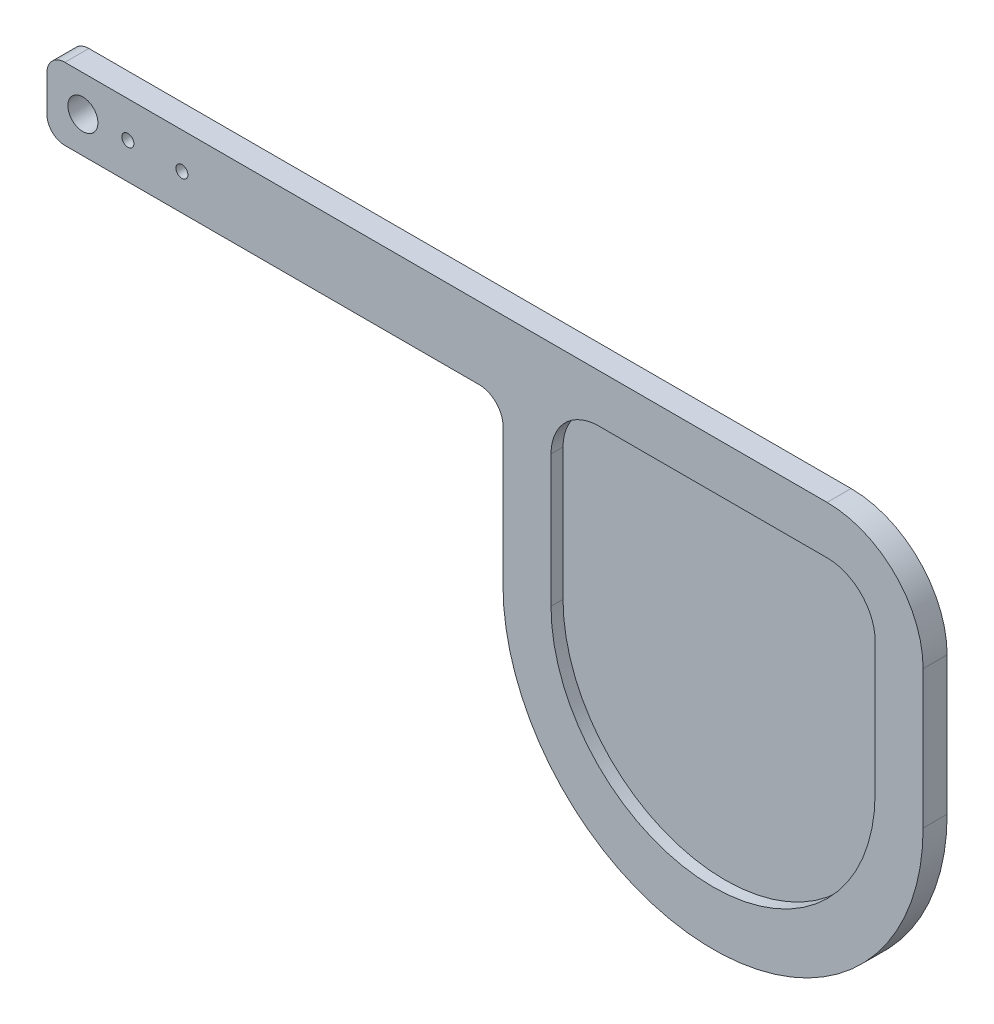
ISO-10303-21;
HEADER;
FILE_DESCRIPTION(('STEP AP214'),'2;1');
FILE_NAME('part.step','',(''),(''),'','','');
FILE_SCHEMA(('AUTOMOTIVE_DESIGN { 1 0 10303 214 1 1 1 1 }'));
ENDSEC;
DATA;
#1=APPLICATION_CONTEXT('core data for automotive mechanical design processes');
#2=APPLICATION_PROTOCOL_DEFINITION('international standard','automotive_design',2000,#1);
#3=PRODUCT_CONTEXT('',#1,'mechanical');
#4=PRODUCT('Part','Part','',(#3));
#5=PRODUCT_RELATED_PRODUCT_CATEGORY('part','',(#4));
#6=PRODUCT_DEFINITION_FORMATION('','',#4);
#7=PRODUCT_DEFINITION_CONTEXT('part definition',#1,'design');
#8=PRODUCT_DEFINITION('design','',#6,#7);
#9=PRODUCT_DEFINITION_SHAPE('','',#8);
#10=(LENGTH_UNIT() NAMED_UNIT(*) SI_UNIT(.MILLI.,.METRE.));
#11=(NAMED_UNIT(*) PLANE_ANGLE_UNIT() SI_UNIT($,.RADIAN.));
#12=(NAMED_UNIT(*) SI_UNIT($,.STERADIAN.) SOLID_ANGLE_UNIT());
#13=UNCERTAINTY_MEASURE_WITH_UNIT(LENGTH_MEASURE(1.E-05),#10,'distance_accuracy_value','');
#14=(GEOMETRIC_REPRESENTATION_CONTEXT(3) GLOBAL_UNCERTAINTY_ASSIGNED_CONTEXT((#13)) GLOBAL_UNIT_ASSIGNED_CONTEXT((#10,
#11,#12)) REPRESENTATION_CONTEXT('',''));
#15=CARTESIAN_POINT('',(0.,0.,0.));
#16=DIRECTION('',(0.,0.,1.));
#17=DIRECTION('',(1.,0.,0.));
#18=AXIS2_PLACEMENT_3D('',#15,#16,#17);
#19=CARTESIAN_POINT('',(72.,-4.,4.));
#20=DIRECTION('',(0.,0.,-1.));
#21=DIRECTION('',(-1.,0.,0.));
#22=AXIS2_PLACEMENT_3D('',#19,#20,#21);
#23=PLANE('',#22);
#24=DIRECTION('',(-1.,0.,0.));
#25=VECTOR('',#24,1.);
#26=CARTESIAN_POINT('',(92.0000000000001,4.,4.));
#27=LINE('',#26,#25);
#28=CARTESIAN_POINT('',(130.,4.,4.));
#29=VERTEX_POINT('',#28);
#30=CARTESIAN_POINT('',(92.0000000000001,4.,4.));
#31=VERTEX_POINT('',#30);
#32=EDGE_CURVE('E273',#29,#31,#27,.T.);
#33=ORIENTED_EDGE('',*,*,#32,.F.);
#34=CARTESIAN_POINT('',(130.,-4.,4.));
#35=DIRECTION('',(0.,0.,1.));
#36=DIRECTION('',(-1.,0.,0.));
#37=AXIS2_PLACEMENT_3D('',#34,#35,#36);
#38=CIRCLE('',#37,8.00000000000002);
#39=CARTESIAN_POINT('',(138.,-4.,4.));
#40=VERTEX_POINT('',#39);
#41=EDGE_CURVE('E52',#40,#29,#38,.T.);
#42=ORIENTED_EDGE('',*,*,#41,.F.);
#43=DIRECTION('',(0.,1.,0.));
#44=VECTOR('',#43,1.);
#45=CARTESIAN_POINT('',(138.,-4.,4.));
#46=LINE('',#45,#44);
#47=CARTESIAN_POINT('',(138.,-26.,4.));
#48=VERTEX_POINT('',#47);
#49=EDGE_CURVE('E260',#48,#40,#46,.T.);
#50=ORIENTED_EDGE('',*,*,#49,.F.);
#51=CARTESIAN_POINT('',(111.,-26.,4.));
#52=DIRECTION('',(0.,0.,1.));
#53=DIRECTION('',(-1.,0.,0.));
#54=AXIS2_PLACEMENT_3D('',#51,#52,#53);
#55=CIRCLE('',#54,27.);
#56=CARTESIAN_POINT('',(84.,-26.,4.));
#57=VERTEX_POINT('',#56);
#58=EDGE_CURVE('E264',#57,#48,#55,.T.);
#59=ORIENTED_EDGE('',*,*,#58,.F.);
#60=DIRECTION('',(0.,-1.,0.));
#61=VECTOR('',#60,1.);
#62=CARTESIAN_POINT('',(84.,-26.,4.));
#63=LINE('',#62,#61);
#64=CARTESIAN_POINT('',(84.,-4.00000000000006,4.));
#65=VERTEX_POINT('',#64);
#66=EDGE_CURVE('E267',#65,#57,#63,.T.);
#67=ORIENTED_EDGE('',*,*,#66,.F.);
#68=CARTESIAN_POINT('',(92.,-4.,4.));
#69=DIRECTION('',(0.,0.,1.));
#70=DIRECTION('',(1.,0.,0.));
#71=AXIS2_PLACEMENT_3D('',#68,#69,#70);
#72=CIRCLE('',#71,8.);
#73=EDGE_CURVE('E270',#31,#65,#72,.T.);
#74=ORIENTED_EDGE('',*,*,#73,.F.);
#75=EDGE_LOOP('',(#33,#42,#50,#59,#67,#74));
#76=FACE_BOUND('',#75,.T.);
#77=CARTESIAN_POINT('',(72.,-4.,4.));
#78=DIRECTION('',(0.,0.,-1.));
#79=DIRECTION('',(-1.,0.,0.));
#80=AXIS2_PLACEMENT_3D('',#77,#78,#79);
#81=CIRCLE('',#80,3.99999999999999);
#82=CARTESIAN_POINT('',(72.,0.,4.));
#83=VERTEX_POINT('',#82);
#84=CARTESIAN_POINT('',(76.,-4.,4.));
#85=VERTEX_POINT('',#84);
#86=EDGE_CURVE('E178',#83,#85,#81,.T.);
#87=ORIENTED_EDGE('',*,*,#86,.T.);
#88=DIRECTION('',(0.,-1.,0.));
#89=VECTOR('',#88,1.);
#90=CARTESIAN_POINT('',(76.,-4.,4.));
#91=LINE('',#90,#89);
#92=CARTESIAN_POINT('',(76.,-27.,4.));
#93=VERTEX_POINT('',#92);
#94=EDGE_CURVE('E108',#85,#93,#91,.T.);
#95=ORIENTED_EDGE('',*,*,#94,.T.);
#96=CARTESIAN_POINT('',(111.,-27.,4.));
#97=DIRECTION('',(0.,0.,1.));
#98=DIRECTION('',(1.,0.,0.));
#99=AXIS2_PLACEMENT_3D('',#96,#97,#98);
#100=CIRCLE('',#99,35.);
#101=CARTESIAN_POINT('',(146.,-27.,4.));
#102=VERTEX_POINT('',#101);
#103=EDGE_CURVE('E199',#93,#102,#100,.T.);
#104=ORIENTED_EDGE('',*,*,#103,.T.);
#105=DIRECTION('',(0.,1.,0.));
#106=VECTOR('',#105,1.);
#107=CARTESIAN_POINT('',(146.,-27.,4.));
#108=LINE('',#107,#106);
#109=CARTESIAN_POINT('',(146.,-3.99999999999998,4.));
#110=VERTEX_POINT('',#109);
#111=EDGE_CURVE('E218',#102,#110,#108,.T.);
#112=ORIENTED_EDGE('',*,*,#111,.T.);
#113=CARTESIAN_POINT('',(130.,-3.99999999999998,4.));
#114=DIRECTION('',(0.,0.,1.));
#115=DIRECTION('',(1.,0.,0.));
#116=AXIS2_PLACEMENT_3D('',#113,#114,#115);
#117=CIRCLE('',#116,16.);
#118=CARTESIAN_POINT('',(130.,12.,4.));
#119=VERTEX_POINT('',#118);
#120=EDGE_CURVE('E215',#110,#119,#117,.T.);
#121=ORIENTED_EDGE('',*,*,#120,.T.);
#122=DIRECTION('',(-1.,0.,0.));
#123=VECTOR('',#122,1.);
#124=CARTESIAN_POINT('',(130.,12.,4.));
#125=LINE('',#124,#123);
#126=CARTESIAN_POINT('',(3.00000000000002,12.,4.));
#127=VERTEX_POINT('',#126);
#128=EDGE_CURVE('E217',#119,#127,#125,.T.);
#129=ORIENTED_EDGE('',*,*,#128,.T.);
#130=CARTESIAN_POINT('',(3.,9.,4.));
#131=DIRECTION('',(0.,0.,1.));
#132=DIRECTION('',(1.,0.,0.));
#133=AXIS2_PLACEMENT_3D('',#130,#131,#132);
#134=CIRCLE('',#133,3.);
#135=CARTESIAN_POINT('',(0.,8.99999999999998,4.));
#136=VERTEX_POINT('',#135);
#137=EDGE_CURVE('E137',#127,#136,#134,.T.);
#138=ORIENTED_EDGE('',*,*,#137,.T.);
#139=DIRECTION('',(0.,-1.,0.));
#140=VECTOR('',#139,1.);
#141=CARTESIAN_POINT('',(0.,8.99999999999998,4.));
#142=LINE('',#141,#140);
#143=CARTESIAN_POINT('',(0.,3.,4.));
#144=VERTEX_POINT('',#143);
#145=EDGE_CURVE('E130',#136,#144,#142,.T.);
#146=ORIENTED_EDGE('',*,*,#145,.T.);
#147=CARTESIAN_POINT('',(3.,3.,4.));
#148=DIRECTION('',(0.,0.,1.));
#149=DIRECTION('',(-1.,0.,0.));
#150=AXIS2_PLACEMENT_3D('',#147,#148,#149);
#151=CIRCLE('',#150,3.);
#152=CARTESIAN_POINT('',(3.00000000000002,0.,4.));
#153=VERTEX_POINT('',#152);
#154=EDGE_CURVE('E134',#144,#153,#151,.T.);
#155=ORIENTED_EDGE('',*,*,#154,.T.);
#156=DIRECTION('',(1.,0.,0.));
#157=VECTOR('',#156,1.);
#158=CARTESIAN_POINT('',(3.00000000000002,0.,4.));
#159=LINE('',#158,#157);
#160=EDGE_CURVE('E61',#153,#83,#159,.T.);
#161=ORIENTED_EDGE('',*,*,#160,.T.);
#162=EDGE_LOOP('',(#87,#95,#104,#112,#121,#129,#138,#146,#155,#161));
#163=FACE_BOUND('',#162,.T.);
#164=CARTESIAN_POINT('',(6.,6.,4.));
#165=DIRECTION('',(0.,0.,1.));
#166=DIRECTION('',(1.,0.,0.));
#167=AXIS2_PLACEMENT_3D('',#164,#165,#166);
#168=CIRCLE('',#167,2.5);
#169=CARTESIAN_POINT('',(8.5,6.,4.));
#170=VERTEX_POINT('',#169);
#171=EDGE_CURVE('E162',#170,#170,#168,.T.);
#172=ORIENTED_EDGE('',*,*,#171,.F.);
#173=EDGE_LOOP('',(#172));
#174=FACE_BOUND('',#173,.T.);
#175=CARTESIAN_POINT('',(13.5,6.,4.));
#176=DIRECTION('',(0.,0.,1.));
#177=DIRECTION('',(1.,0.,0.));
#178=AXIS2_PLACEMENT_3D('',#175,#176,#177);
#179=CIRCLE('',#178,1.);
#180=CARTESIAN_POINT('',(14.5,6.,4.));
#181=VERTEX_POINT('',#180);
#182=EDGE_CURVE('E229',#181,#181,#179,.T.);
#183=ORIENTED_EDGE('',*,*,#182,.F.);
#184=EDGE_LOOP('',(#183));
#185=FACE_BOUND('',#184,.T.);
#186=CARTESIAN_POINT('',(22.5,6.,4.));
#187=DIRECTION('',(0.,0.,1.));
#188=DIRECTION('',(1.,0.,0.));
#189=AXIS2_PLACEMENT_3D('',#186,#187,#188);
#190=CIRCLE('',#189,1.);
#191=CARTESIAN_POINT('',(23.5,6.,4.));
#192=VERTEX_POINT('',#191);
#193=EDGE_CURVE('E235',#192,#192,#190,.T.);
#194=ORIENTED_EDGE('',*,*,#193,.F.);
#195=EDGE_LOOP('',(#194));
#196=FACE_BOUND('',#195,.T.);
#197=ADVANCED_FACE('F37',(#76,#163,#174,#185,#196),#23,.F.);
#198=CARTESIAN_POINT('',(72.,-4.,0.));
#199=DIRECTION('',(0.,0.,-1.));
#200=DIRECTION('',(-1.,0.,0.));
#201=AXIS2_PLACEMENT_3D('',#198,#199,#200);
#202=PLANE('',#201);
#203=CARTESIAN_POINT('',(13.5,6.,0.));
#204=DIRECTION('',(0.,0.,1.));
#205=DIRECTION('',(1.,0.,0.));
#206=AXIS2_PLACEMENT_3D('',#203,#204,#205);
#207=CIRCLE('',#206,1.);
#208=CARTESIAN_POINT('',(14.5,6.,0.));
#209=VERTEX_POINT('',#208);
#210=EDGE_CURVE('E232',#209,#209,#207,.T.);
#211=ORIENTED_EDGE('',*,*,#210,.T.);
#212=EDGE_LOOP('',(#211));
#213=FACE_BOUND('',#212,.T.);
#214=CARTESIAN_POINT('',(72.,-4.,0.));
#215=DIRECTION('',(0.,0.,-1.));
#216=DIRECTION('',(-1.,0.,0.));
#217=AXIS2_PLACEMENT_3D('',#214,#215,#216);
#218=CIRCLE('',#217,3.99999999999999);
#219=CARTESIAN_POINT('',(72.,0.,0.));
#220=VERTEX_POINT('',#219);
#221=CARTESIAN_POINT('',(76.,-4.,0.));
#222=VERTEX_POINT('',#221);
#223=EDGE_CURVE('E158',#220,#222,#218,.T.);
#224=ORIENTED_EDGE('',*,*,#223,.F.);
#225=DIRECTION('',(1.,0.,0.));
#226=VECTOR('',#225,1.);
#227=CARTESIAN_POINT('',(3.00000000000002,0.,0.));
#228=LINE('',#227,#226);
#229=CARTESIAN_POINT('',(3.00000000000002,0.,0.));
#230=VERTEX_POINT('',#229);
#231=EDGE_CURVE('E100',#230,#220,#228,.T.);
#232=ORIENTED_EDGE('',*,*,#231,.F.);
#233=CARTESIAN_POINT('',(3.,3.,0.));
#234=DIRECTION('',(0.,0.,1.));
#235=DIRECTION('',(-1.,0.,0.));
#236=AXIS2_PLACEMENT_3D('',#233,#234,#235);
#237=CIRCLE('',#236,3.);
#238=CARTESIAN_POINT('',(0.,3.,0.));
#239=VERTEX_POINT('',#238);
#240=EDGE_CURVE('E175',#239,#230,#237,.T.);
#241=ORIENTED_EDGE('',*,*,#240,.F.);
#242=DIRECTION('',(0.,-1.,0.));
#243=VECTOR('',#242,1.);
#244=CARTESIAN_POINT('',(0.,8.99999999999998,0.));
#245=LINE('',#244,#243);
#246=CARTESIAN_POINT('',(0.,8.99999999999998,0.));
#247=VERTEX_POINT('',#246);
#248=EDGE_CURVE('E146',#247,#239,#245,.T.);
#249=ORIENTED_EDGE('',*,*,#248,.F.);
#250=CARTESIAN_POINT('',(3.,9.,0.));
#251=DIRECTION('',(0.,0.,1.));
#252=DIRECTION('',(1.,0.,0.));
#253=AXIS2_PLACEMENT_3D('',#250,#251,#252);
#254=CIRCLE('',#253,3.);
#255=CARTESIAN_POINT('',(3.00000000000002,12.,0.));
#256=VERTEX_POINT('',#255);
#257=EDGE_CURVE('E172',#256,#247,#254,.T.);
#258=ORIENTED_EDGE('',*,*,#257,.F.);
#259=DIRECTION('',(-1.,0.,0.));
#260=VECTOR('',#259,1.);
#261=CARTESIAN_POINT('',(130.,12.,0.));
#262=LINE('',#261,#260);
#263=CARTESIAN_POINT('',(130.,12.,0.));
#264=VERTEX_POINT('',#263);
#265=EDGE_CURVE('E170',#264,#256,#262,.T.);
#266=ORIENTED_EDGE('',*,*,#265,.F.);
#267=CARTESIAN_POINT('',(130.,-3.99999999999998,0.));
#268=DIRECTION('',(0.,0.,1.));
#269=DIRECTION('',(1.,0.,0.));
#270=AXIS2_PLACEMENT_3D('',#267,#268,#269);
#271=CIRCLE('',#270,16.);
#272=CARTESIAN_POINT('',(146.,-3.99999999999998,0.));
#273=VERTEX_POINT('',#272);
#274=EDGE_CURVE('E168',#273,#264,#271,.T.);
#275=ORIENTED_EDGE('',*,*,#274,.F.);
#276=DIRECTION('',(0.,1.,0.));
#277=VECTOR('',#276,1.);
#278=CARTESIAN_POINT('',(146.,-27.,0.));
#279=LINE('',#278,#277);
#280=CARTESIAN_POINT('',(146.,-27.,0.));
#281=VERTEX_POINT('',#280);
#282=EDGE_CURVE('E166',#281,#273,#279,.T.);
#283=ORIENTED_EDGE('',*,*,#282,.F.);
#284=CARTESIAN_POINT('',(111.,-27.,0.));
#285=DIRECTION('',(0.,0.,1.));
#286=DIRECTION('',(1.,0.,0.));
#287=AXIS2_PLACEMENT_3D('',#284,#285,#286);
#288=CIRCLE('',#287,35.);
#289=CARTESIAN_POINT('',(76.,-27.,0.));
#290=VERTEX_POINT('',#289);
#291=EDGE_CURVE('E164',#290,#281,#288,.T.);
#292=ORIENTED_EDGE('',*,*,#291,.F.);
#293=DIRECTION('',(0.,-1.,0.));
#294=VECTOR('',#293,1.);
#295=CARTESIAN_POINT('',(76.,-4.,0.));
#296=LINE('',#295,#294);
#297=EDGE_CURVE('E161',#222,#290,#296,.T.);
#298=ORIENTED_EDGE('',*,*,#297,.F.);
#299=EDGE_LOOP('',(#224,#232,#241,#249,#258,#266,#275,#283,#292,#298));
#300=FACE_BOUND('',#299,.T.);
#301=CARTESIAN_POINT('',(6.,6.,0.));
#302=DIRECTION('',(0.,0.,1.));
#303=DIRECTION('',(1.,0.,0.));
#304=AXIS2_PLACEMENT_3D('',#301,#302,#303);
#305=CIRCLE('',#304,2.5);
#306=CARTESIAN_POINT('',(8.5,6.,0.));
#307=VERTEX_POINT('',#306);
#308=EDGE_CURVE('E226',#307,#307,#305,.T.);
#309=ORIENTED_EDGE('',*,*,#308,.T.);
#310=EDGE_LOOP('',(#309));
#311=FACE_BOUND('',#310,.T.);
#312=CARTESIAN_POINT('',(22.5,6.,0.));
#313=DIRECTION('',(0.,0.,1.));
#314=DIRECTION('',(1.,0.,0.));
#315=AXIS2_PLACEMENT_3D('',#312,#313,#314);
#316=CIRCLE('',#315,1.);
#317=CARTESIAN_POINT('',(23.5,6.,0.));
#318=VERTEX_POINT('',#317);
#319=EDGE_CURVE('E238',#318,#318,#316,.T.);
#320=ORIENTED_EDGE('',*,*,#319,.T.);
#321=EDGE_LOOP('',(#320));
#322=FACE_BOUND('',#321,.T.);
#323=ADVANCED_FACE('F203',(#213,#300,#311,#322),#202,.T.);
#324=CARTESIAN_POINT('',(72.,-4.,4.));
#325=DIRECTION('',(0.,0.,-1.));
#326=DIRECTION('',(-1.,0.,0.));
#327=AXIS2_PLACEMENT_3D('',#324,#325,#326);
#328=CYLINDRICAL_SURFACE('',#327,3.99999999999999);
#329=ORIENTED_EDGE('',*,*,#223,.T.);
#330=DIRECTION('',(0.,0.,-1.));
#331=VECTOR('',#330,1.);
#332=CARTESIAN_POINT('',(76.,-4.,4.));
#333=LINE('',#332,#331);
#334=EDGE_CURVE('E11',#85,#222,#333,.T.);
#335=ORIENTED_EDGE('',*,*,#334,.F.);
#336=ORIENTED_EDGE('',*,*,#86,.F.);
#337=DIRECTION('',(0.,0.,-1.));
#338=VECTOR('',#337,1.);
#339=CARTESIAN_POINT('',(72.,0.,4.));
#340=LINE('',#339,#338);
#341=EDGE_CURVE('E154',#83,#220,#340,.T.);
#342=ORIENTED_EDGE('',*,*,#341,.T.);
#343=EDGE_LOOP('',(#329,#335,#336,#342));
#344=FACE_BOUND('',#343,.T.);
#345=ADVANCED_FACE('F39',(#344),#328,.F.);
#346=CARTESIAN_POINT('',(76.,-4.,4.));
#347=DIRECTION('',(1.,0.,0.));
#348=DIRECTION('',(0.,1.,0.));
#349=AXIS2_PLACEMENT_3D('',#346,#347,#348);
#350=PLANE('',#349);
#351=ORIENTED_EDGE('',*,*,#297,.T.);
#352=DIRECTION('',(0.,0.,-1.));
#353=VECTOR('',#352,1.);
#354=CARTESIAN_POINT('',(76.,-27.,4.));
#355=LINE('',#354,#353);
#356=EDGE_CURVE('E45',#93,#290,#355,.T.);
#357=ORIENTED_EDGE('',*,*,#356,.F.);
#358=ORIENTED_EDGE('',*,*,#94,.F.);
#359=ORIENTED_EDGE('',*,*,#334,.T.);
#360=EDGE_LOOP('',(#351,#357,#358,#359));
#361=FACE_BOUND('',#360,.T.);
#362=ADVANCED_FACE('F379',(#361),#350,.F.);
#363=CARTESIAN_POINT('',(111.,-27.,4.));
#364=DIRECTION('',(0.,0.,-1.));
#365=DIRECTION('',(-1.,0.,0.));
#366=AXIS2_PLACEMENT_3D('',#363,#364,#365);
#367=CYLINDRICAL_SURFACE('',#366,35.);
#368=ORIENTED_EDGE('',*,*,#291,.T.);
#369=DIRECTION('',(0.,0.,-1.));
#370=VECTOR('',#369,1.);
#371=CARTESIAN_POINT('',(146.,-27.,4.));
#372=LINE('',#371,#370);
#373=EDGE_CURVE('E191',#102,#281,#372,.T.);
#374=ORIENTED_EDGE('',*,*,#373,.F.);
#375=ORIENTED_EDGE('',*,*,#103,.F.);
#376=ORIENTED_EDGE('',*,*,#356,.T.);
#377=EDGE_LOOP('',(#368,#374,#375,#376));
#378=FACE_BOUND('',#377,.T.);
#379=ADVANCED_FACE('F197',(#378),#367,.T.);
#380=CARTESIAN_POINT('',(146.,-27.,4.));
#381=DIRECTION('',(-1.,0.,0.));
#382=DIRECTION('',(0.,0.,1.));
#383=AXIS2_PLACEMENT_3D('',#380,#381,#382);
#384=PLANE('',#383);
#385=ORIENTED_EDGE('',*,*,#282,.T.);
#386=DIRECTION('',(0.,0.,-1.));
#387=VECTOR('',#386,1.);
#388=CARTESIAN_POINT('',(146.,-3.99999999999998,4.));
#389=LINE('',#388,#387);
#390=EDGE_CURVE('E188',#110,#273,#389,.T.);
#391=ORIENTED_EDGE('',*,*,#390,.F.);
#392=ORIENTED_EDGE('',*,*,#111,.F.);
#393=ORIENTED_EDGE('',*,*,#373,.T.);
#394=EDGE_LOOP('',(#385,#391,#392,#393));
#395=FACE_BOUND('',#394,.T.);
#396=ADVANCED_FACE('F209',(#395),#384,.F.);
#397=CARTESIAN_POINT('',(130.,-3.99999999999998,4.));
#398=DIRECTION('',(0.,0.,-1.));
#399=DIRECTION('',(-1.,0.,0.));
#400=AXIS2_PLACEMENT_3D('',#397,#398,#399);
#401=CYLINDRICAL_SURFACE('',#400,16.);
#402=ORIENTED_EDGE('',*,*,#274,.T.);
#403=DIRECTION('',(0.,0.,-1.));
#404=VECTOR('',#403,1.);
#405=CARTESIAN_POINT('',(130.,12.,4.));
#406=LINE('',#405,#404);
#407=EDGE_CURVE('E185',#119,#264,#406,.T.);
#408=ORIENTED_EDGE('',*,*,#407,.F.);
#409=ORIENTED_EDGE('',*,*,#120,.F.);
#410=ORIENTED_EDGE('',*,*,#390,.T.);
#411=EDGE_LOOP('',(#402,#408,#409,#410));
#412=FACE_BOUND('',#411,.T.);
#413=ADVANCED_FACE('F213',(#412),#401,.T.);
#414=CARTESIAN_POINT('',(130.,12.,4.));
#415=DIRECTION('',(0.,-1.,0.));
#416=DIRECTION('',(1.,0.,0.));
#417=AXIS2_PLACEMENT_3D('',#414,#415,#416);
#418=PLANE('',#417);
#419=ORIENTED_EDGE('',*,*,#265,.T.);
#420=DIRECTION('',(0.,0.,-1.));
#421=VECTOR('',#420,1.);
#422=CARTESIAN_POINT('',(3.00000000000002,12.,4.));
#423=LINE('',#422,#421);
#424=EDGE_CURVE('E182',#127,#256,#423,.T.);
#425=ORIENTED_EDGE('',*,*,#424,.F.);
#426=ORIENTED_EDGE('',*,*,#128,.F.);
#427=ORIENTED_EDGE('',*,*,#407,.T.);
#428=EDGE_LOOP('',(#419,#425,#426,#427));
#429=FACE_BOUND('',#428,.T.);
#430=ADVANCED_FACE('F369',(#429),#418,.F.);
#431=CARTESIAN_POINT('',(3.,9.,4.));
#432=DIRECTION('',(0.,0.,-1.));
#433=DIRECTION('',(-1.,0.,0.));
#434=AXIS2_PLACEMENT_3D('',#431,#432,#433);
#435=CYLINDRICAL_SURFACE('',#434,3.);
#436=ORIENTED_EDGE('',*,*,#257,.T.);
#437=DIRECTION('',(0.,0.,-1.));
#438=VECTOR('',#437,1.);
#439=CARTESIAN_POINT('',(0.,8.99999999999998,4.));
#440=LINE('',#439,#438);
#441=EDGE_CURVE('E149',#136,#247,#440,.T.);
#442=ORIENTED_EDGE('',*,*,#441,.F.);
#443=ORIENTED_EDGE('',*,*,#137,.F.);
#444=ORIENTED_EDGE('',*,*,#424,.T.);
#445=EDGE_LOOP('',(#436,#442,#443,#444));
#446=FACE_BOUND('',#445,.T.);
#447=ADVANCED_FACE('F366',(#446),#435,.T.);
#448=CARTESIAN_POINT('',(0.,8.99999999999998,4.));
#449=DIRECTION('',(1.,0.,0.));
#450=DIRECTION('',(0.,0.,-1.));
#451=AXIS2_PLACEMENT_3D('',#448,#449,#450);
#452=PLANE('',#451);
#453=ORIENTED_EDGE('',*,*,#248,.T.);
#454=DIRECTION('',(0.,0.,-1.));
#455=VECTOR('',#454,1.);
#456=CARTESIAN_POINT('',(0.,3.,4.));
#457=LINE('',#456,#455);
#458=EDGE_CURVE('E143',#144,#239,#457,.T.);
#459=ORIENTED_EDGE('',*,*,#458,.F.);
#460=ORIENTED_EDGE('',*,*,#145,.F.);
#461=ORIENTED_EDGE('',*,*,#441,.T.);
#462=EDGE_LOOP('',(#453,#459,#460,#461));
#463=FACE_BOUND('',#462,.T.);
#464=ADVANCED_FACE('F144',(#463),#452,.F.);
#465=CARTESIAN_POINT('',(3.,3.,4.));
#466=DIRECTION('',(0.,0.,-1.));
#467=DIRECTION('',(-1.,0.,0.));
#468=AXIS2_PLACEMENT_3D('',#465,#466,#467);
#469=CYLINDRICAL_SURFACE('',#468,3.);
#470=ORIENTED_EDGE('',*,*,#240,.T.);
#471=DIRECTION('',(0.,0.,-1.));
#472=VECTOR('',#471,1.);
#473=CARTESIAN_POINT('',(3.00000000000002,0.,4.));
#474=LINE('',#473,#472);
#475=EDGE_CURVE('E150',#153,#230,#474,.T.);
#476=ORIENTED_EDGE('',*,*,#475,.F.);
#477=ORIENTED_EDGE('',*,*,#154,.F.);
#478=ORIENTED_EDGE('',*,*,#458,.T.);
#479=EDGE_LOOP('',(#470,#476,#477,#478));
#480=FACE_BOUND('',#479,.T.);
#481=ADVANCED_FACE('F152',(#480),#469,.T.);
#482=CARTESIAN_POINT('',(3.00000000000002,0.,4.));
#483=DIRECTION('',(0.,1.,0.));
#484=DIRECTION('',(0.,0.,1.));
#485=AXIS2_PLACEMENT_3D('',#482,#483,#484);
#486=PLANE('',#485);
#487=ORIENTED_EDGE('',*,*,#231,.T.);
#488=ORIENTED_EDGE('',*,*,#341,.F.);
#489=ORIENTED_EDGE('',*,*,#160,.F.);
#490=ORIENTED_EDGE('',*,*,#475,.T.);
#491=EDGE_LOOP('',(#487,#488,#489,#490));
#492=FACE_BOUND('',#491,.T.);
#493=ADVANCED_FACE('F359',(#492),#486,.F.);
#494=CARTESIAN_POINT('',(6.,6.,4.));
#495=DIRECTION('',(0.,0.,-1.));
#496=DIRECTION('',(-1.,0.,0.));
#497=AXIS2_PLACEMENT_3D('',#494,#495,#496);
#498=CYLINDRICAL_SURFACE('',#497,2.5);
#499=ORIENTED_EDGE('',*,*,#171,.T.);
#500=EDGE_LOOP('',(#499));
#501=FACE_BOUND('',#500,.T.);
#502=ORIENTED_EDGE('',*,*,#308,.F.);
#503=EDGE_LOOP('',(#502));
#504=FACE_BOUND('',#503,.T.);
#505=ADVANCED_FACE('F356',(#501,#504),#498,.F.);
#506=CARTESIAN_POINT('',(13.5,6.,4.));
#507=DIRECTION('',(0.,0.,-1.));
#508=DIRECTION('',(-1.,0.,0.));
#509=AXIS2_PLACEMENT_3D('',#506,#507,#508);
#510=CYLINDRICAL_SURFACE('',#509,1.);
#511=ORIENTED_EDGE('',*,*,#182,.T.);
#512=EDGE_LOOP('',(#511));
#513=FACE_BOUND('',#512,.T.);
#514=ORIENTED_EDGE('',*,*,#210,.F.);
#515=EDGE_LOOP('',(#514));
#516=FACE_BOUND('',#515,.T.);
#517=ADVANCED_FACE('F454',(#513,#516),#510,.F.);
#518=CARTESIAN_POINT('',(22.5,6.,4.));
#519=DIRECTION('',(0.,0.,-1.));
#520=DIRECTION('',(-1.,0.,0.));
#521=AXIS2_PLACEMENT_3D('',#518,#519,#520);
#522=CYLINDRICAL_SURFACE('',#521,1.);
#523=ORIENTED_EDGE('',*,*,#193,.T.);
#524=EDGE_LOOP('',(#523));
#525=FACE_BOUND('',#524,.T.);
#526=ORIENTED_EDGE('',*,*,#319,.F.);
#527=EDGE_LOOP('',(#526));
#528=FACE_BOUND('',#527,.T.);
#529=ADVANCED_FACE('F462',(#525,#528),#522,.F.);
#530=CARTESIAN_POINT('',(130.,-4.,2.));
#531=DIRECTION('',(0.,0.,1.));
#532=DIRECTION('',(1.,0.,0.));
#533=AXIS2_PLACEMENT_3D('',#530,#531,#532);
#534=CYLINDRICAL_SURFACE('',#533,8.00000000000002);
#535=ORIENTED_EDGE('',*,*,#41,.T.);
#536=DIRECTION('',(0.,0.,1.));
#537=VECTOR('',#536,1.);
#538=CARTESIAN_POINT('',(130.,4.,2.));
#539=LINE('',#538,#537);
#540=CARTESIAN_POINT('',(130.,4.,2.));
#541=VERTEX_POINT('',#540);
#542=EDGE_CURVE('E244',#541,#29,#539,.T.);
#543=ORIENTED_EDGE('',*,*,#542,.F.);
#544=CARTESIAN_POINT('',(130.,-4.,2.));
#545=DIRECTION('',(0.,0.,1.));
#546=DIRECTION('',(-1.,0.,0.));
#547=AXIS2_PLACEMENT_3D('',#544,#545,#546);
#548=CIRCLE('',#547,8.00000000000002);
#549=CARTESIAN_POINT('',(138.,-4.,2.));
#550=VERTEX_POINT('',#549);
#551=EDGE_CURVE('E263',#550,#541,#548,.T.);
#552=ORIENTED_EDGE('',*,*,#551,.F.);
#553=DIRECTION('',(0.,0.,1.));
#554=VECTOR('',#553,1.);
#555=CARTESIAN_POINT('',(138.,-4.,2.));
#556=LINE('',#555,#554);
#557=EDGE_CURVE('E241',#550,#40,#556,.T.);
#558=ORIENTED_EDGE('',*,*,#557,.T.);
#559=EDGE_LOOP('',(#535,#543,#552,#558));
#560=FACE_BOUND('',#559,.T.);
#561=ADVANCED_FACE('F300',(#560),#534,.F.);
#562=CARTESIAN_POINT('',(138.,-4.,2.));
#563=DIRECTION('',(1.,0.,0.));
#564=DIRECTION('',(0.,1.,0.));
#565=AXIS2_PLACEMENT_3D('',#562,#563,#564);
#566=PLANE('',#565);
#567=ORIENTED_EDGE('',*,*,#49,.T.);
#568=ORIENTED_EDGE('',*,*,#557,.F.);
#569=DIRECTION('',(0.,1.,0.));
#570=VECTOR('',#569,1.);
#571=CARTESIAN_POINT('',(138.,-4.,2.));
#572=LINE('',#571,#570);
#573=CARTESIAN_POINT('',(138.,-26.,2.));
#574=VERTEX_POINT('',#573);
#575=EDGE_CURVE('E247',#574,#550,#572,.T.);
#576=ORIENTED_EDGE('',*,*,#575,.F.);
#577=DIRECTION('',(0.,0.,1.));
#578=VECTOR('',#577,1.);
#579=CARTESIAN_POINT('',(138.,-26.,2.));
#580=LINE('',#579,#578);
#581=EDGE_CURVE('E256',#574,#48,#580,.T.);
#582=ORIENTED_EDGE('',*,*,#581,.T.);
#583=EDGE_LOOP('',(#567,#568,#576,#582));
#584=FACE_BOUND('',#583,.T.);
#585=ADVANCED_FACE('F316',(#584),#566,.F.);
#586=CARTESIAN_POINT('',(111.,-26.,2.));
#587=DIRECTION('',(0.,0.,1.));
#588=DIRECTION('',(1.,0.,0.));
#589=AXIS2_PLACEMENT_3D('',#586,#587,#588);
#590=CYLINDRICAL_SURFACE('',#589,27.);
#591=ORIENTED_EDGE('',*,*,#58,.T.);
#592=ORIENTED_EDGE('',*,*,#581,.F.);
#593=CARTESIAN_POINT('',(111.,-26.,2.));
#594=DIRECTION('',(0.,0.,1.));
#595=DIRECTION('',(-1.,0.,0.));
#596=AXIS2_PLACEMENT_3D('',#593,#594,#595);
#597=CIRCLE('',#596,27.);
#598=CARTESIAN_POINT('',(84.,-26.,2.));
#599=VERTEX_POINT('',#598);
#600=EDGE_CURVE('E279',#599,#574,#597,.T.);
#601=ORIENTED_EDGE('',*,*,#600,.F.);
#602=DIRECTION('',(0.,0.,1.));
#603=VECTOR('',#602,1.);
#604=CARTESIAN_POINT('',(84.,-26.,2.));
#605=LINE('',#604,#603);
#606=EDGE_CURVE('E253',#599,#57,#605,.T.);
#607=ORIENTED_EDGE('',*,*,#606,.T.);
#608=EDGE_LOOP('',(#591,#592,#601,#607));
#609=FACE_BOUND('',#608,.T.);
#610=ADVANCED_FACE('F321',(#609),#590,.F.);
#611=CARTESIAN_POINT('',(84.,-26.,2.));
#612=DIRECTION('',(-1.,0.,0.));
#613=DIRECTION('',(0.,0.,1.));
#614=AXIS2_PLACEMENT_3D('',#611,#612,#613);
#615=PLANE('',#614);
#616=ORIENTED_EDGE('',*,*,#66,.T.);
#617=ORIENTED_EDGE('',*,*,#606,.F.);
#618=DIRECTION('',(0.,-1.,0.));
#619=VECTOR('',#618,1.);
#620=CARTESIAN_POINT('',(84.,-26.,2.));
#621=LINE('',#620,#619);
#622=CARTESIAN_POINT('',(84.,-4.00000000000006,2.));
#623=VERTEX_POINT('',#622);
#624=EDGE_CURVE('E282',#623,#599,#621,.T.);
#625=ORIENTED_EDGE('',*,*,#624,.F.);
#626=DIRECTION('',(0.,0.,1.));
#627=VECTOR('',#626,1.);
#628=CARTESIAN_POINT('',(84.,-4.00000000000006,2.));
#629=LINE('',#628,#627);
#630=EDGE_CURVE('E250',#623,#65,#629,.T.);
#631=ORIENTED_EDGE('',*,*,#630,.T.);
#632=EDGE_LOOP('',(#616,#617,#625,#631));
#633=FACE_BOUND('',#632,.T.);
#634=ADVANCED_FACE('F339',(#633),#615,.F.);
#635=CARTESIAN_POINT('',(92.,-4.,2.));
#636=DIRECTION('',(0.,0.,1.));
#637=DIRECTION('',(1.,0.,0.));
#638=AXIS2_PLACEMENT_3D('',#635,#636,#637);
#639=CYLINDRICAL_SURFACE('',#638,8.);
#640=ORIENTED_EDGE('',*,*,#73,.T.);
#641=ORIENTED_EDGE('',*,*,#630,.F.);
#642=CARTESIAN_POINT('',(92.,-4.,2.));
#643=DIRECTION('',(0.,0.,1.));
#644=DIRECTION('',(1.,0.,0.));
#645=AXIS2_PLACEMENT_3D('',#642,#643,#644);
#646=CIRCLE('',#645,8.);
#647=CARTESIAN_POINT('',(92.0000000000001,4.,2.));
#648=VERTEX_POINT('',#647);
#649=EDGE_CURVE('E285',#648,#623,#646,.T.);
#650=ORIENTED_EDGE('',*,*,#649,.F.);
#651=DIRECTION('',(0.,0.,1.));
#652=VECTOR('',#651,1.);
#653=CARTESIAN_POINT('',(92.0000000000001,4.,2.));
#654=LINE('',#653,#652);
#655=EDGE_CURVE('E246',#648,#31,#654,.T.);
#656=ORIENTED_EDGE('',*,*,#655,.T.);
#657=EDGE_LOOP('',(#640,#641,#650,#656));
#658=FACE_BOUND('',#657,.T.);
#659=ADVANCED_FACE('F335',(#658),#639,.F.);
#660=CARTESIAN_POINT('',(92.0000000000001,4.,2.));
#661=DIRECTION('',(0.,1.,0.));
#662=DIRECTION('',(-1.,0.,0.));
#663=AXIS2_PLACEMENT_3D('',#660,#661,#662);
#664=PLANE('',#663);
#665=ORIENTED_EDGE('',*,*,#32,.T.);
#666=ORIENTED_EDGE('',*,*,#655,.F.);
#667=DIRECTION('',(-1.,0.,0.));
#668=VECTOR('',#667,1.);
#669=CARTESIAN_POINT('',(92.0000000000001,4.,2.));
#670=LINE('',#669,#668);
#671=EDGE_CURVE('E288',#541,#648,#670,.T.);
#672=ORIENTED_EDGE('',*,*,#671,.F.);
#673=ORIENTED_EDGE('',*,*,#542,.T.);
#674=EDGE_LOOP('',(#665,#666,#672,#673));
#675=FACE_BOUND('',#674,.T.);
#676=ADVANCED_FACE('F329',(#675),#664,.F.);
#677=CARTESIAN_POINT('',(130.,-4.,2.));
#678=DIRECTION('',(0.,0.,-1.));
#679=DIRECTION('',(-1.,0.,0.));
#680=AXIS2_PLACEMENT_3D('',#677,#678,#679);
#681=PLANE('',#680);
#682=ORIENTED_EDGE('',*,*,#551,.T.);
#683=ORIENTED_EDGE('',*,*,#671,.T.);
#684=ORIENTED_EDGE('',*,*,#649,.T.);
#685=ORIENTED_EDGE('',*,*,#624,.T.);
#686=ORIENTED_EDGE('',*,*,#600,.T.);
#687=ORIENTED_EDGE('',*,*,#575,.T.);
#688=EDGE_LOOP('',(#682,#683,#684,#685,#686,#687));
#689=FACE_BOUND('',#688,.T.);
#690=ADVANCED_FACE('F295',(#689),#681,.F.);
#691=CLOSED_SHELL('',(#197,#323,#345,#362,#379,#396,#413,#430,#447,#464,#481,#493,#505,#517,
#529,#561,#585,#610,#634,#659,#676,#690));
#692=MANIFOLD_SOLID_BREP('B2',#691);
#693=ADVANCED_BREP_SHAPE_REPRESENTATION('',(#18,#692),#14);
#694=SHAPE_DEFINITION_REPRESENTATION(#9,#693);
ENDSEC;
END-ISO-10303-21;
